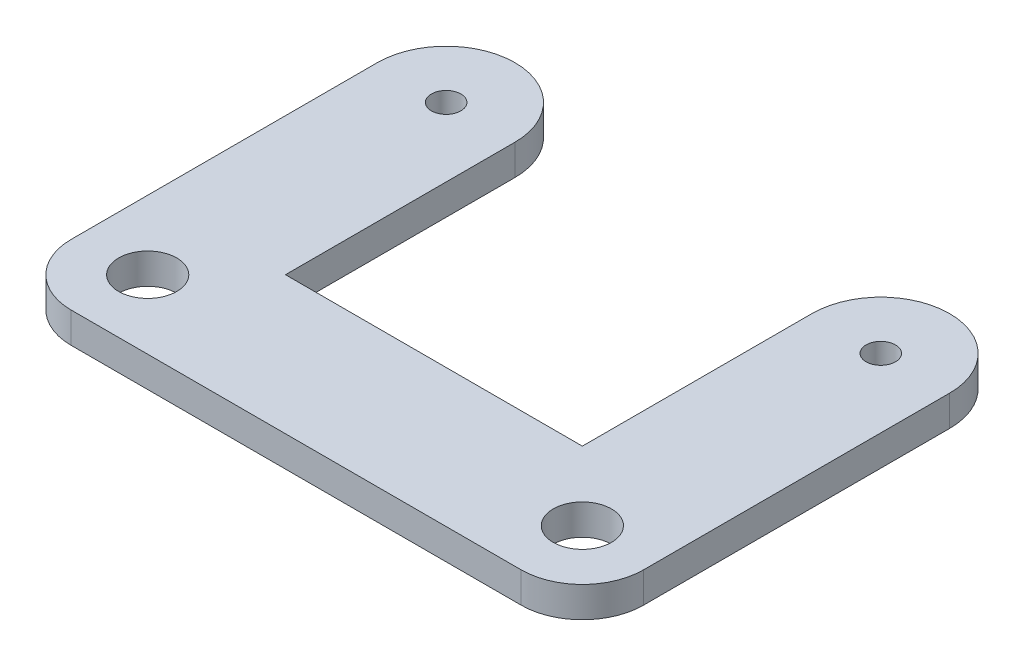
ISO-10303-21;
HEADER;
FILE_DESCRIPTION(('STEP AP214'),'2;1');
FILE_NAME('part.step','',(''),(''),'','','');
FILE_SCHEMA(('AUTOMOTIVE_DESIGN { 1 0 10303 214 1 1 1 1 }'));
ENDSEC;
DATA;
#1=APPLICATION_CONTEXT('core data for automotive mechanical design processes');
#2=APPLICATION_PROTOCOL_DEFINITION('international standard','automotive_design',2000,#1);
#3=PRODUCT_CONTEXT('',#1,'mechanical');
#4=PRODUCT('Part','Part','',(#3));
#5=PRODUCT_RELATED_PRODUCT_CATEGORY('part','',(#4));
#6=PRODUCT_DEFINITION_FORMATION('','',#4);
#7=PRODUCT_DEFINITION_CONTEXT('part definition',#1,'design');
#8=PRODUCT_DEFINITION('design','',#6,#7);
#9=PRODUCT_DEFINITION_SHAPE('','',#8);
#10=(LENGTH_UNIT() NAMED_UNIT(*) SI_UNIT(.MILLI.,.METRE.));
#11=(NAMED_UNIT(*) PLANE_ANGLE_UNIT() SI_UNIT($,.RADIAN.));
#12=(NAMED_UNIT(*) SI_UNIT($,.STERADIAN.) SOLID_ANGLE_UNIT());
#13=UNCERTAINTY_MEASURE_WITH_UNIT(LENGTH_MEASURE(1.E-05),#10,'distance_accuracy_value','');
#14=(GEOMETRIC_REPRESENTATION_CONTEXT(3) GLOBAL_UNCERTAINTY_ASSIGNED_CONTEXT((#13)) GLOBAL_UNIT_ASSIGNED_CONTEXT((#10,
#11,#12)) REPRESENTATION_CONTEXT('',''));
#15=CARTESIAN_POINT('',(0.,0.,0.));
#16=DIRECTION('',(0.,0.,1.));
#17=DIRECTION('',(1.,0.,0.));
#18=AXIS2_PLACEMENT_3D('',#15,#16,#17);
#19=CARTESIAN_POINT('',(46.75,5.,0.));
#20=DIRECTION('',(-1.,0.,0.));
#21=DIRECTION('',(0.,0.,1.));
#22=AXIS2_PLACEMENT_3D('',#19,#20,#21);
#23=PLANE('',#22);
#24=DIRECTION('',(0.,0.,-1.));
#25=VECTOR('',#24,1.);
#26=CARTESIAN_POINT('',(46.75,5.,0.));
#27=LINE('',#26,#25);
#28=CARTESIAN_POINT('',(46.75,5.,50.));
#29=VERTEX_POINT('',#28);
#30=CARTESIAN_POINT('',(46.75,5.,0.));
#31=VERTEX_POINT('',#30);
#32=EDGE_CURVE('E119',#29,#31,#27,.T.);
#33=ORIENTED_EDGE('',*,*,#32,.F.);
#34=DIRECTION('',(0.,-1.,0.));
#35=VECTOR('',#34,1.);
#36=CARTESIAN_POINT('',(46.75,5.,50.));
#37=LINE('',#36,#35);
#38=CARTESIAN_POINT('',(46.75,0.,50.));
#39=VERTEX_POINT('',#38);
#40=EDGE_CURVE('E145',#29,#39,#37,.T.);
#41=ORIENTED_EDGE('',*,*,#40,.T.);
#42=DIRECTION('',(0.,0.,-1.));
#43=VECTOR('',#42,1.);
#44=CARTESIAN_POINT('',(46.75,0.,0.));
#45=LINE('',#44,#43);
#46=CARTESIAN_POINT('',(46.75,0.,0.));
#47=VERTEX_POINT('',#46);
#48=EDGE_CURVE('E143',#39,#47,#45,.T.);
#49=ORIENTED_EDGE('',*,*,#48,.T.);
#50=DIRECTION('',(0.,-1.,0.));
#51=VECTOR('',#50,1.);
#52=CARTESIAN_POINT('',(46.75,5.,0.));
#53=LINE('',#52,#51);
#54=EDGE_CURVE('E137',#31,#47,#53,.T.);
#55=ORIENTED_EDGE('',*,*,#54,.F.);
#56=EDGE_LOOP('',(#33,#41,#49,#55));
#57=FACE_BOUND('',#56,.T.);
#58=ADVANCED_FACE('F41',(#57),#23,.F.);
#59=CARTESIAN_POINT('',(35.5,5.,0.));
#60=DIRECTION('',(0.,-1.,0.));
#61=DIRECTION('',(0.,0.,-1.));
#62=AXIS2_PLACEMENT_3D('',#59,#60,#61);
#63=CYLINDRICAL_SURFACE('',#62,11.25);
#64=CARTESIAN_POINT('',(35.5,0.,0.));
#65=DIRECTION('',(0.,1.,0.));
#66=DIRECTION('',(0.,0.,1.));
#67=AXIS2_PLACEMENT_3D('',#64,#65,#66);
#68=CIRCLE('',#67,11.25);
#69=CARTESIAN_POINT('',(24.25,0.,0.));
#70=VERTEX_POINT('',#69);
#71=EDGE_CURVE('E214',#47,#70,#68,.T.);
#72=ORIENTED_EDGE('',*,*,#71,.T.);
#73=DIRECTION('',(0.,-1.,0.));
#74=VECTOR('',#73,1.);
#75=CARTESIAN_POINT('',(24.25,5.,0.));
#76=LINE('',#75,#74);
#77=CARTESIAN_POINT('',(24.25,5.,0.));
#78=VERTEX_POINT('',#77);
#79=EDGE_CURVE('E138',#78,#70,#76,.T.);
#80=ORIENTED_EDGE('',*,*,#79,.F.);
#81=CARTESIAN_POINT('',(35.5,5.,0.));
#82=DIRECTION('',(0.,1.,0.));
#83=DIRECTION('',(0.,0.,1.));
#84=AXIS2_PLACEMENT_3D('',#81,#82,#83);
#85=CIRCLE('',#84,11.25);
#86=EDGE_CURVE('E124',#31,#78,#85,.T.);
#87=ORIENTED_EDGE('',*,*,#86,.F.);
#88=ORIENTED_EDGE('',*,*,#54,.T.);
#89=EDGE_LOOP('',(#72,#80,#87,#88));
#90=FACE_BOUND('',#89,.T.);
#91=ADVANCED_FACE('F136',(#90),#63,.T.);
#92=CARTESIAN_POINT('',(24.25,5.,0.));
#93=DIRECTION('',(-1.,0.,0.));
#94=DIRECTION('',(0.,0.,1.));
#95=AXIS2_PLACEMENT_3D('',#92,#93,#94);
#96=PLANE('',#95);
#97=DIRECTION('',(0.,0.,-1.));
#98=VECTOR('',#97,1.);
#99=CARTESIAN_POINT('',(24.25,0.,0.));
#100=LINE('',#99,#98);
#101=CARTESIAN_POINT('',(24.25,0.,37.5));
#102=VERTEX_POINT('',#101);
#103=EDGE_CURVE('E212',#102,#70,#100,.T.);
#104=ORIENTED_EDGE('',*,*,#103,.F.);
#105=DIRECTION('',(0.,-1.,0.));
#106=VECTOR('',#105,1.);
#107=CARTESIAN_POINT('',(24.25,5.,37.5));
#108=LINE('',#107,#106);
#109=CARTESIAN_POINT('',(24.25,5.,37.5));
#110=VERTEX_POINT('',#109);
#111=EDGE_CURVE('E149',#110,#102,#108,.T.);
#112=ORIENTED_EDGE('',*,*,#111,.F.);
#113=DIRECTION('',(0.,0.,-1.));
#114=VECTOR('',#113,1.);
#115=CARTESIAN_POINT('',(24.25,5.,0.));
#116=LINE('',#115,#114);
#117=EDGE_CURVE('E140',#110,#78,#116,.T.);
#118=ORIENTED_EDGE('',*,*,#117,.T.);
#119=ORIENTED_EDGE('',*,*,#79,.T.);
#120=EDGE_LOOP('',(#104,#112,#118,#119));
#121=FACE_BOUND('',#120,.T.);
#122=ADVANCED_FACE('F213',(#121),#96,.T.);
#123=CARTESIAN_POINT('',(0.,5.,37.5));
#124=DIRECTION('',(0.,0.,-1.));
#125=DIRECTION('',(-1.,0.,0.));
#126=AXIS2_PLACEMENT_3D('',#123,#124,#125);
#127=PLANE('',#126);
#128=DIRECTION('',(1.,0.,0.));
#129=VECTOR('',#128,1.);
#130=CARTESIAN_POINT('',(0.,0.,37.5));
#131=LINE('',#130,#129);
#132=CARTESIAN_POINT('',(-24.25,0.,37.5));
#133=VERTEX_POINT('',#132);
#134=EDGE_CURVE('E206',#133,#102,#131,.T.);
#135=ORIENTED_EDGE('',*,*,#134,.F.);
#136=DIRECTION('',(0.,-1.,0.));
#137=VECTOR('',#136,1.);
#138=CARTESIAN_POINT('',(-24.25,5.,37.5));
#139=LINE('',#138,#137);
#140=CARTESIAN_POINT('',(-24.25,5.,37.5));
#141=VERTEX_POINT('',#140);
#142=EDGE_CURVE('E199',#141,#133,#139,.T.);
#143=ORIENTED_EDGE('',*,*,#142,.F.);
#144=DIRECTION('',(1.,0.,0.));
#145=VECTOR('',#144,1.);
#146=CARTESIAN_POINT('',(0.,5.,37.5));
#147=LINE('',#146,#145);
#148=EDGE_CURVE('E209',#141,#110,#147,.T.);
#149=ORIENTED_EDGE('',*,*,#148,.T.);
#150=ORIENTED_EDGE('',*,*,#111,.T.);
#151=EDGE_LOOP('',(#135,#143,#149,#150));
#152=FACE_BOUND('',#151,.T.);
#153=ADVANCED_FACE('F204',(#152),#127,.T.);
#154=CARTESIAN_POINT('',(-24.25,5.,0.));
#155=DIRECTION('',(1.,0.,0.));
#156=DIRECTION('',(0.,0.,-1.));
#157=AXIS2_PLACEMENT_3D('',#154,#155,#156);
#158=PLANE('',#157);
#159=DIRECTION('',(0.,0.,1.));
#160=VECTOR('',#159,1.);
#161=CARTESIAN_POINT('',(-24.25,0.,0.));
#162=LINE('',#161,#160);
#163=CARTESIAN_POINT('',(-24.25,0.,0.));
#164=VERTEX_POINT('',#163);
#165=EDGE_CURVE('E185',#164,#133,#162,.T.);
#166=ORIENTED_EDGE('',*,*,#165,.F.);
#167=DIRECTION('',(0.,-1.,0.));
#168=VECTOR('',#167,1.);
#169=CARTESIAN_POINT('',(-24.25,5.,0.));
#170=LINE('',#169,#168);
#171=CARTESIAN_POINT('',(-24.25,5.,0.));
#172=VERTEX_POINT('',#171);
#173=EDGE_CURVE('E196',#172,#164,#170,.T.);
#174=ORIENTED_EDGE('',*,*,#173,.F.);
#175=DIRECTION('',(0.,0.,1.));
#176=VECTOR('',#175,1.);
#177=CARTESIAN_POINT('',(-24.25,5.,0.));
#178=LINE('',#177,#176);
#179=EDGE_CURVE('E234',#172,#141,#178,.T.);
#180=ORIENTED_EDGE('',*,*,#179,.T.);
#181=ORIENTED_EDGE('',*,*,#142,.T.);
#182=EDGE_LOOP('',(#166,#174,#180,#181));
#183=FACE_BOUND('',#182,.T.);
#184=ADVANCED_FACE('F296',(#183),#158,.T.);
#185=CARTESIAN_POINT('',(-35.5,5.,0.));
#186=DIRECTION('',(0.,-1.,0.));
#187=DIRECTION('',(0.,0.,-1.));
#188=AXIS2_PLACEMENT_3D('',#185,#186,#187);
#189=CYLINDRICAL_SURFACE('',#188,11.25);
#190=CARTESIAN_POINT('',(-35.5,0.,0.));
#191=DIRECTION('',(0.,1.,0.));
#192=DIRECTION('',(0.,0.,1.));
#193=AXIS2_PLACEMENT_3D('',#190,#191,#192);
#194=CIRCLE('',#193,11.25);
#195=CARTESIAN_POINT('',(-46.75,0.,0.));
#196=VERTEX_POINT('',#195);
#197=EDGE_CURVE('E181',#164,#196,#194,.T.);
#198=ORIENTED_EDGE('',*,*,#197,.T.);
#199=DIRECTION('',(0.,-1.,0.));
#200=VECTOR('',#199,1.);
#201=CARTESIAN_POINT('',(-46.75,5.,0.));
#202=LINE('',#201,#200);
#203=CARTESIAN_POINT('',(-46.75,5.,0.));
#204=VERTEX_POINT('',#203);
#205=EDGE_CURVE('E180',#204,#196,#202,.T.);
#206=ORIENTED_EDGE('',*,*,#205,.F.);
#207=CARTESIAN_POINT('',(-35.5,5.,0.));
#208=DIRECTION('',(0.,1.,0.));
#209=DIRECTION('',(0.,0.,1.));
#210=AXIS2_PLACEMENT_3D('',#207,#208,#209);
#211=CIRCLE('',#210,11.25);
#212=EDGE_CURVE('E232',#172,#204,#211,.T.);
#213=ORIENTED_EDGE('',*,*,#212,.F.);
#214=ORIENTED_EDGE('',*,*,#173,.T.);
#215=EDGE_LOOP('',(#198,#206,#213,#214));
#216=FACE_BOUND('',#215,.T.);
#217=ADVANCED_FACE('F293',(#216),#189,.T.);
#218=CARTESIAN_POINT('',(-46.75,5.,0.));
#219=DIRECTION('',(1.,0.,0.));
#220=DIRECTION('',(0.,0.,-1.));
#221=AXIS2_PLACEMENT_3D('',#218,#219,#220);
#222=PLANE('',#221);
#223=DIRECTION('',(0.,0.,1.));
#224=VECTOR('',#223,1.);
#225=CARTESIAN_POINT('',(-46.75,0.,0.));
#226=LINE('',#225,#224);
#227=CARTESIAN_POINT('',(-46.75,0.,50.));
#228=VERTEX_POINT('',#227);
#229=EDGE_CURVE('E175',#196,#228,#226,.T.);
#230=ORIENTED_EDGE('',*,*,#229,.T.);
#231=DIRECTION('',(0.,-1.,0.));
#232=VECTOR('',#231,1.);
#233=CARTESIAN_POINT('',(-46.75,5.,50.));
#234=LINE('',#233,#232);
#235=CARTESIAN_POINT('',(-46.75,5.,50.));
#236=VERTEX_POINT('',#235);
#237=EDGE_CURVE('E11',#228,#236,#234,.F.);
#238=ORIENTED_EDGE('',*,*,#237,.T.);
#239=DIRECTION('',(0.,0.,1.));
#240=VECTOR('',#239,1.);
#241=CARTESIAN_POINT('',(-46.75,5.,0.));
#242=LINE('',#241,#240);
#243=EDGE_CURVE('E163',#204,#236,#242,.T.);
#244=ORIENTED_EDGE('',*,*,#243,.F.);
#245=ORIENTED_EDGE('',*,*,#205,.T.);
#246=EDGE_LOOP('',(#230,#238,#244,#245));
#247=FACE_BOUND('',#246,.T.);
#248=ADVANCED_FACE('F178',(#247),#222,.F.);
#249=CARTESIAN_POINT('',(-35.5,5.,0.));
#250=DIRECTION('',(0.,-1.,0.));
#251=DIRECTION('',(0.,0.,-1.));
#252=AXIS2_PLACEMENT_3D('',#249,#250,#251);
#253=CYLINDRICAL_SURFACE('',#252,2.4);
#254=CARTESIAN_POINT('',(-35.5,5.,0.));
#255=DIRECTION('',(0.,1.,0.));
#256=DIRECTION('',(0.,0.,1.));
#257=AXIS2_PLACEMENT_3D('',#254,#255,#256);
#258=CIRCLE('',#257,2.4);
#259=CARTESIAN_POINT('',(-35.5,5.,2.40000000000001));
#260=VERTEX_POINT('',#259);
#261=EDGE_CURVE('E168',#260,#260,#258,.T.);
#262=ORIENTED_EDGE('',*,*,#261,.T.);
#263=EDGE_LOOP('',(#262));
#264=FACE_BOUND('',#263,.T.);
#265=CARTESIAN_POINT('',(-35.5,0.,0.));
#266=DIRECTION('',(0.,1.,0.));
#267=DIRECTION('',(0.,0.,1.));
#268=AXIS2_PLACEMENT_3D('',#265,#266,#267);
#269=CIRCLE('',#268,2.4);
#270=CARTESIAN_POINT('',(-35.5,0.,2.40000000000001));
#271=VERTEX_POINT('',#270);
#272=EDGE_CURVE('E183',#271,#271,#269,.T.);
#273=ORIENTED_EDGE('',*,*,#272,.F.);
#274=EDGE_LOOP('',(#273));
#275=FACE_BOUND('',#274,.T.);
#276=ADVANCED_FACE('F286',(#264,#275),#253,.F.);
#277=CARTESIAN_POINT('',(0.,5.,60.));
#278=DIRECTION('',(0.,0.,-1.));
#279=DIRECTION('',(-1.,0.,0.));
#280=AXIS2_PLACEMENT_3D('',#277,#278,#279);
#281=PLANE('',#280);
#282=DIRECTION('',(1.,0.,0.));
#283=VECTOR('',#282,1.);
#284=CARTESIAN_POINT('',(0.,0.,60.));
#285=LINE('',#284,#283);
#286=CARTESIAN_POINT('',(-36.75,0.,60.));
#287=VERTEX_POINT('',#286);
#288=CARTESIAN_POINT('',(36.75,0.,60.));
#289=VERTEX_POINT('',#288);
#290=EDGE_CURVE('E176',#287,#289,#285,.T.);
#291=ORIENTED_EDGE('',*,*,#290,.T.);
#292=DIRECTION('',(0.,-1.,0.));
#293=VECTOR('',#292,1.);
#294=CARTESIAN_POINT('',(36.75,5.,60.));
#295=LINE('',#294,#293);
#296=CARTESIAN_POINT('',(36.75,5.,60.));
#297=VERTEX_POINT('',#296);
#298=EDGE_CURVE('E62',#289,#297,#295,.F.);
#299=ORIENTED_EDGE('',*,*,#298,.T.);
#300=DIRECTION('',(1.,0.,0.));
#301=VECTOR('',#300,1.);
#302=CARTESIAN_POINT('',(0.,5.,60.));
#303=LINE('',#302,#301);
#304=CARTESIAN_POINT('',(-36.75,5.,60.));
#305=VERTEX_POINT('',#304);
#306=EDGE_CURVE('E162',#305,#297,#303,.T.);
#307=ORIENTED_EDGE('',*,*,#306,.F.);
#308=DIRECTION('',(0.,-1.,0.));
#309=VECTOR('',#308,1.);
#310=CARTESIAN_POINT('',(-36.75,5.,60.));
#311=LINE('',#310,#309);
#312=EDGE_CURVE('E156',#305,#287,#311,.T.);
#313=ORIENTED_EDGE('',*,*,#312,.T.);
#314=EDGE_LOOP('',(#291,#299,#307,#313));
#315=FACE_BOUND('',#314,.T.);
#316=ADVANCED_FACE('F166',(#315),#281,.F.);
#317=CARTESIAN_POINT('',(-35.5,5.,48.75));
#318=DIRECTION('',(0.,-1.,0.));
#319=DIRECTION('',(0.,0.,-1.));
#320=AXIS2_PLACEMENT_3D('',#317,#318,#319);
#321=CYLINDRICAL_SURFACE('',#320,4.75);
#322=CARTESIAN_POINT('',(-35.5,5.,48.75));
#323=DIRECTION('',(0.,1.,0.));
#324=DIRECTION('',(0.,0.,1.));
#325=AXIS2_PLACEMENT_3D('',#322,#323,#324);
#326=CIRCLE('',#325,4.75);
#327=CARTESIAN_POINT('',(-35.5,5.,53.5));
#328=VERTEX_POINT('',#327);
#329=EDGE_CURVE('E131',#328,#328,#326,.T.);
#330=ORIENTED_EDGE('',*,*,#329,.T.);
#331=EDGE_LOOP('',(#330));
#332=FACE_BOUND('',#331,.T.);
#333=CARTESIAN_POINT('',(-35.5,0.,48.75));
#334=DIRECTION('',(0.,1.,0.));
#335=DIRECTION('',(0.,0.,1.));
#336=AXIS2_PLACEMENT_3D('',#333,#334,#335);
#337=CIRCLE('',#336,4.75);
#338=CARTESIAN_POINT('',(-35.5,0.,53.5));
#339=VERTEX_POINT('',#338);
#340=EDGE_CURVE('E221',#339,#339,#337,.T.);
#341=ORIENTED_EDGE('',*,*,#340,.F.);
#342=EDGE_LOOP('',(#341));
#343=FACE_BOUND('',#342,.T.);
#344=ADVANCED_FACE('F253',(#332,#343),#321,.F.);
#345=CARTESIAN_POINT('',(35.5,5.,48.75));
#346=DIRECTION('',(0.,-1.,0.));
#347=DIRECTION('',(0.,0.,-1.));
#348=AXIS2_PLACEMENT_3D('',#345,#346,#347);
#349=CYLINDRICAL_SURFACE('',#348,4.75);
#350=CARTESIAN_POINT('',(35.5,5.,48.75));
#351=DIRECTION('',(0.,1.,0.));
#352=DIRECTION('',(0.,0.,1.));
#353=AXIS2_PLACEMENT_3D('',#350,#351,#352);
#354=CIRCLE('',#353,4.75);
#355=CARTESIAN_POINT('',(35.5,5.,53.5));
#356=VERTEX_POINT('',#355);
#357=EDGE_CURVE('E194',#356,#356,#354,.T.);
#358=ORIENTED_EDGE('',*,*,#357,.T.);
#359=EDGE_LOOP('',(#358));
#360=FACE_BOUND('',#359,.T.);
#361=CARTESIAN_POINT('',(35.5,0.,48.75));
#362=DIRECTION('',(0.,1.,0.));
#363=DIRECTION('',(0.,0.,1.));
#364=AXIS2_PLACEMENT_3D('',#361,#362,#363);
#365=CIRCLE('',#364,4.75);
#366=CARTESIAN_POINT('',(35.5,0.,53.5));
#367=VERTEX_POINT('',#366);
#368=EDGE_CURVE('E224',#367,#367,#365,.T.);
#369=ORIENTED_EDGE('',*,*,#368,.F.);
#370=EDGE_LOOP('',(#369));
#371=FACE_BOUND('',#370,.T.);
#372=ADVANCED_FACE('F244',(#360,#371),#349,.F.);
#373=CARTESIAN_POINT('',(35.5,5.,0.));
#374=DIRECTION('',(0.,-1.,0.));
#375=DIRECTION('',(0.,0.,-1.));
#376=AXIS2_PLACEMENT_3D('',#373,#374,#375);
#377=CYLINDRICAL_SURFACE('',#376,2.4);
#378=CARTESIAN_POINT('',(35.5,5.,0.));
#379=DIRECTION('',(0.,1.,0.));
#380=DIRECTION('',(0.,0.,1.));
#381=AXIS2_PLACEMENT_3D('',#378,#379,#380);
#382=CIRCLE('',#381,2.4);
#383=CARTESIAN_POINT('',(35.5,5.,2.40000000000001));
#384=VERTEX_POINT('',#383);
#385=EDGE_CURVE('E197',#384,#384,#382,.T.);
#386=ORIENTED_EDGE('',*,*,#385,.T.);
#387=EDGE_LOOP('',(#386));
#388=FACE_BOUND('',#387,.T.);
#389=CARTESIAN_POINT('',(35.5,0.,0.));
#390=DIRECTION('',(0.,1.,0.));
#391=DIRECTION('',(0.,0.,1.));
#392=AXIS2_PLACEMENT_3D('',#389,#390,#391);
#393=CIRCLE('',#392,2.4);
#394=CARTESIAN_POINT('',(35.5,0.,2.40000000000001));
#395=VERTEX_POINT('',#394);
#396=EDGE_CURVE('E191',#395,#395,#393,.T.);
#397=ORIENTED_EDGE('',*,*,#396,.F.);
#398=EDGE_LOOP('',(#397));
#399=FACE_BOUND('',#398,.T.);
#400=ADVANCED_FACE('F249',(#388,#399),#377,.F.);
#401=CARTESIAN_POINT('',(0.,5.,0.));
#402=DIRECTION('',(0.,1.,0.));
#403=DIRECTION('',(0.,0.,1.));
#404=AXIS2_PLACEMENT_3D('',#401,#402,#403);
#405=PLANE('',#404);
#406=ORIENTED_EDGE('',*,*,#357,.F.);
#407=EDGE_LOOP('',(#406));
#408=FACE_BOUND('',#407,.T.);
#409=ORIENTED_EDGE('',*,*,#329,.F.);
#410=EDGE_LOOP('',(#409));
#411=FACE_BOUND('',#410,.T.);
#412=ORIENTED_EDGE('',*,*,#306,.T.);
#413=CARTESIAN_POINT('',(36.75,5.,50.));
#414=DIRECTION('',(0.,1.,0.));
#415=DIRECTION('',(0.,0.,1.));
#416=AXIS2_PLACEMENT_3D('',#413,#414,#415);
#417=CIRCLE('',#416,10.);
#418=EDGE_CURVE('E49',#297,#29,#417,.T.);
#419=ORIENTED_EDGE('',*,*,#418,.T.);
#420=ORIENTED_EDGE('',*,*,#32,.T.);
#421=ORIENTED_EDGE('',*,*,#86,.T.);
#422=ORIENTED_EDGE('',*,*,#117,.F.);
#423=ORIENTED_EDGE('',*,*,#148,.F.);
#424=ORIENTED_EDGE('',*,*,#179,.F.);
#425=ORIENTED_EDGE('',*,*,#212,.T.);
#426=ORIENTED_EDGE('',*,*,#243,.T.);
#427=CARTESIAN_POINT('',(-36.75,5.,50.));
#428=DIRECTION('',(0.,1.,0.));
#429=DIRECTION('',(0.,0.,1.));
#430=AXIS2_PLACEMENT_3D('',#427,#428,#429);
#431=CIRCLE('',#430,10.);
#432=EDGE_CURVE('E160',#236,#305,#431,.T.);
#433=ORIENTED_EDGE('',*,*,#432,.T.);
#434=EDGE_LOOP('',(#412,#419,#420,#421,#422,#423,#424,#425,#426,#433));
#435=FACE_BOUND('',#434,.T.);
#436=ORIENTED_EDGE('',*,*,#261,.F.);
#437=EDGE_LOOP('',(#436));
#438=FACE_BOUND('',#437,.T.);
#439=ORIENTED_EDGE('',*,*,#385,.F.);
#440=EDGE_LOOP('',(#439));
#441=FACE_BOUND('',#440,.T.);
#442=ADVANCED_FACE('F121',(#408,#411,#435,#438,#441),#405,.T.);
#443=CARTESIAN_POINT('',(0.,0.,0.));
#444=DIRECTION('',(0.,1.,0.));
#445=DIRECTION('',(0.,0.,1.));
#446=AXIS2_PLACEMENT_3D('',#443,#444,#445);
#447=PLANE('',#446);
#448=ORIENTED_EDGE('',*,*,#368,.T.);
#449=EDGE_LOOP('',(#448));
#450=FACE_BOUND('',#449,.T.);
#451=ORIENTED_EDGE('',*,*,#340,.T.);
#452=EDGE_LOOP('',(#451));
#453=FACE_BOUND('',#452,.T.);
#454=ORIENTED_EDGE('',*,*,#48,.F.);
#455=CARTESIAN_POINT('',(36.75,0.,50.));
#456=DIRECTION('',(0.,1.,0.));
#457=DIRECTION('',(0.,0.,1.));
#458=AXIS2_PLACEMENT_3D('',#455,#456,#457);
#459=CIRCLE('',#458,10.);
#460=EDGE_CURVE('E154',#39,#289,#459,.F.);
#461=ORIENTED_EDGE('',*,*,#460,.T.);
#462=ORIENTED_EDGE('',*,*,#290,.F.);
#463=CARTESIAN_POINT('',(-36.75,0.,50.));
#464=DIRECTION('',(0.,1.,0.));
#465=DIRECTION('',(0.,0.,1.));
#466=AXIS2_PLACEMENT_3D('',#463,#464,#465);
#467=CIRCLE('',#466,10.);
#468=EDGE_CURVE('E147',#287,#228,#467,.F.);
#469=ORIENTED_EDGE('',*,*,#468,.T.);
#470=ORIENTED_EDGE('',*,*,#229,.F.);
#471=ORIENTED_EDGE('',*,*,#197,.F.);
#472=ORIENTED_EDGE('',*,*,#165,.T.);
#473=ORIENTED_EDGE('',*,*,#134,.T.);
#474=ORIENTED_EDGE('',*,*,#103,.T.);
#475=ORIENTED_EDGE('',*,*,#71,.F.);
#476=EDGE_LOOP('',(#454,#461,#462,#469,#470,#471,#472,#473,#474,#475));
#477=FACE_BOUND('',#476,.T.);
#478=ORIENTED_EDGE('',*,*,#272,.T.);
#479=EDGE_LOOP('',(#478));
#480=FACE_BOUND('',#479,.T.);
#481=ORIENTED_EDGE('',*,*,#396,.T.);
#482=EDGE_LOOP('',(#481));
#483=FACE_BOUND('',#482,.T.);
#484=ADVANCED_FACE('F172',(#450,#453,#477,#480,#483),#447,.F.);
#485=CARTESIAN_POINT('',(36.75,5.,50.));
#486=DIRECTION('',(0.,-1.,0.));
#487=DIRECTION('',(0.,0.,-1.));
#488=AXIS2_PLACEMENT_3D('',#485,#486,#487);
#489=CYLINDRICAL_SURFACE('',#488,10.);
#490=ORIENTED_EDGE('',*,*,#418,.F.);
#491=ORIENTED_EDGE('',*,*,#298,.F.);
#492=ORIENTED_EDGE('',*,*,#460,.F.);
#493=ORIENTED_EDGE('',*,*,#40,.F.);
#494=EDGE_LOOP('',(#490,#491,#492,#493));
#495=FACE_BOUND('',#494,.T.);
#496=ADVANCED_FACE('F260',(#495),#489,.T.);
#497=CARTESIAN_POINT('',(-36.75,5.,50.));
#498=DIRECTION('',(0.,-1.,0.));
#499=DIRECTION('',(0.,0.,-1.));
#500=AXIS2_PLACEMENT_3D('',#497,#498,#499);
#501=CYLINDRICAL_SURFACE('',#500,10.);
#502=ORIENTED_EDGE('',*,*,#432,.F.);
#503=ORIENTED_EDGE('',*,*,#237,.F.);
#504=ORIENTED_EDGE('',*,*,#468,.F.);
#505=ORIENTED_EDGE('',*,*,#312,.F.);
#506=EDGE_LOOP('',(#502,#503,#504,#505));
#507=FACE_BOUND('',#506,.T.);
#508=ADVANCED_FACE('F43',(#507),#501,.T.);
#509=CLOSED_SHELL('',(#58,#91,#122,#153,#184,#217,#248,#276,#316,#344,#372,#400,#442,#484,#496,#508));
#510=MANIFOLD_SOLID_BREP('B2',#509);
#511=ADVANCED_BREP_SHAPE_REPRESENTATION('',(#18,#510),#14);
#512=SHAPE_DEFINITION_REPRESENTATION(#9,#511);
ENDSEC;
END-ISO-10303-21;
